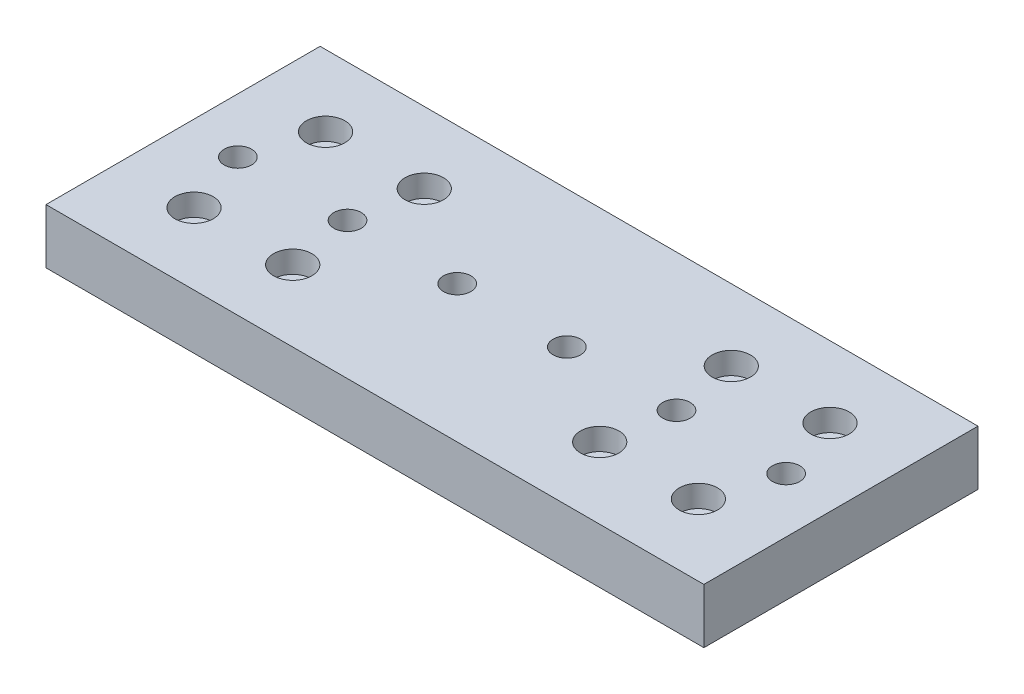
ISO-10303-21;
HEADER;
FILE_DESCRIPTION(('STEP AP214'),'2;1');
FILE_NAME('part.step','',(''),(''),'','','');
FILE_SCHEMA(('AUTOMOTIVE_DESIGN { 1 0 10303 214 1 1 1 1 }'));
ENDSEC;
DATA;
#1=APPLICATION_CONTEXT('core data for automotive mechanical design processes');
#2=APPLICATION_PROTOCOL_DEFINITION('international standard','automotive_design',2000,#1);
#3=PRODUCT_CONTEXT('',#1,'mechanical');
#4=PRODUCT('Part','Part','',(#3));
#5=PRODUCT_RELATED_PRODUCT_CATEGORY('part','',(#4));
#6=PRODUCT_DEFINITION_FORMATION('','',#4);
#7=PRODUCT_DEFINITION_CONTEXT('part definition',#1,'design');
#8=PRODUCT_DEFINITION('design','',#6,#7);
#9=PRODUCT_DEFINITION_SHAPE('','',#8);
#10=(LENGTH_UNIT() NAMED_UNIT(*) SI_UNIT(.MILLI.,.METRE.));
#11=(NAMED_UNIT(*) PLANE_ANGLE_UNIT() SI_UNIT($,.RADIAN.));
#12=(NAMED_UNIT(*) SI_UNIT($,.STERADIAN.) SOLID_ANGLE_UNIT());
#13=UNCERTAINTY_MEASURE_WITH_UNIT(LENGTH_MEASURE(1.E-05),#10,'distance_accuracy_value','');
#14=(GEOMETRIC_REPRESENTATION_CONTEXT(3) GLOBAL_UNCERTAINTY_ASSIGNED_CONTEXT((#13)) GLOBAL_UNIT_ASSIGNED_CONTEXT((#10,
#11,#12)) REPRESENTATION_CONTEXT('',''));
#15=CARTESIAN_POINT('',(0.,0.,0.));
#16=DIRECTION('',(0.,0.,1.));
#17=DIRECTION('',(1.,0.,0.));
#18=AXIS2_PLACEMENT_3D('',#15,#16,#17);
#19=CARTESIAN_POINT('',(50.,10.,0.));
#20=DIRECTION('',(0.,-1.,0.));
#21=DIRECTION('',(0.,0.,-1.));
#22=AXIS2_PLACEMENT_3D('',#19,#20,#21);
#23=CYLINDRICAL_SURFACE('',#22,2.49999999999999);
#24=CARTESIAN_POINT('',(50.,10.,0.));
#25=DIRECTION('',(0.,-1.,0.));
#26=DIRECTION('',(0.,0.,-1.));
#27=AXIS2_PLACEMENT_3D('',#24,#25,#26);
#28=CIRCLE('',#27,2.49999999999999);
#29=CARTESIAN_POINT('',(50.,10.,-2.49999999999999));
#30=VERTEX_POINT('',#29);
#31=EDGE_CURVE('E157',#30,#30,#28,.T.);
#32=ORIENTED_EDGE('',*,*,#31,.F.);
#33=EDGE_LOOP('',(#32));
#34=FACE_BOUND('',#33,.T.);
#35=CARTESIAN_POINT('',(50.,5.,0.));
#36=DIRECTION('',(0.,-1.,0.));
#37=DIRECTION('',(0.,0.,-1.));
#38=AXIS2_PLACEMENT_3D('',#35,#36,#37);
#39=CIRCLE('',#38,2.49999999999999);
#40=CARTESIAN_POINT('',(50.,5.,-2.49999999999999));
#41=VERTEX_POINT('',#40);
#42=EDGE_CURVE('E42',#41,#41,#39,.F.);
#43=ORIENTED_EDGE('',*,*,#42,.F.);
#44=EDGE_LOOP('',(#43));
#45=FACE_BOUND('',#44,.T.);
#46=ADVANCED_FACE('F38',(#34,#45),#23,.F.);
#47=CARTESIAN_POINT('',(30.,10.,0.));
#48=DIRECTION('',(0.,-1.,0.));
#49=DIRECTION('',(0.,0.,-1.));
#50=AXIS2_PLACEMENT_3D('',#47,#48,#49);
#51=CYLINDRICAL_SURFACE('',#50,2.49999999999999);
#52=CARTESIAN_POINT('',(30.,10.,0.));
#53=DIRECTION('',(0.,-1.,0.));
#54=DIRECTION('',(0.,0.,-1.));
#55=AXIS2_PLACEMENT_3D('',#52,#53,#54);
#56=CIRCLE('',#55,2.49999999999999);
#57=CARTESIAN_POINT('',(30.,10.,-2.49999999999999));
#58=VERTEX_POINT('',#57);
#59=EDGE_CURVE('E161',#58,#58,#56,.T.);
#60=ORIENTED_EDGE('',*,*,#59,.F.);
#61=EDGE_LOOP('',(#60));
#62=FACE_BOUND('',#61,.T.);
#63=CARTESIAN_POINT('',(30.,5.,0.));
#64=DIRECTION('',(0.,-1.,0.));
#65=DIRECTION('',(0.,0.,-1.));
#66=AXIS2_PLACEMENT_3D('',#63,#64,#65);
#67=CIRCLE('',#66,2.49999999999999);
#68=CARTESIAN_POINT('',(30.,5.,-2.49999999999999));
#69=VERTEX_POINT('',#68);
#70=EDGE_CURVE('E152',#69,#69,#67,.F.);
#71=ORIENTED_EDGE('',*,*,#70,.F.);
#72=EDGE_LOOP('',(#71));
#73=FACE_BOUND('',#72,.T.);
#74=ADVANCED_FACE('F262',(#62,#73),#51,.F.);
#75=CARTESIAN_POINT('',(9.99999999999999,10.,0.));
#76=DIRECTION('',(0.,-1.,0.));
#77=DIRECTION('',(0.,0.,-1.));
#78=AXIS2_PLACEMENT_3D('',#75,#76,#77);
#79=CYLINDRICAL_SURFACE('',#78,2.5);
#80=CARTESIAN_POINT('',(9.99999999999999,10.,0.));
#81=DIRECTION('',(0.,-1.,0.));
#82=DIRECTION('',(0.,0.,-1.));
#83=AXIS2_PLACEMENT_3D('',#80,#81,#82);
#84=CIRCLE('',#83,2.5);
#85=CARTESIAN_POINT('',(9.99999999999999,10.,-2.5));
#86=VERTEX_POINT('',#85);
#87=EDGE_CURVE('E166',#86,#86,#84,.T.);
#88=ORIENTED_EDGE('',*,*,#87,.F.);
#89=EDGE_LOOP('',(#88));
#90=FACE_BOUND('',#89,.T.);
#91=CARTESIAN_POINT('',(9.99999999999999,5.,0.));
#92=DIRECTION('',(0.,-1.,0.));
#93=DIRECTION('',(0.,0.,-1.));
#94=AXIS2_PLACEMENT_3D('',#91,#92,#93);
#95=CIRCLE('',#94,2.5);
#96=CARTESIAN_POINT('',(9.99999999999999,5.,-2.5));
#97=VERTEX_POINT('',#96);
#98=EDGE_CURVE('E150',#97,#97,#95,.F.);
#99=ORIENTED_EDGE('',*,*,#98,.F.);
#100=EDGE_LOOP('',(#99));
#101=FACE_BOUND('',#100,.T.);
#102=ADVANCED_FACE('F269',(#90,#101),#79,.F.);
#103=CARTESIAN_POINT('',(-10.,10.,0.));
#104=DIRECTION('',(0.,-1.,0.));
#105=DIRECTION('',(0.,0.,-1.));
#106=AXIS2_PLACEMENT_3D('',#103,#104,#105);
#107=CYLINDRICAL_SURFACE('',#106,2.5);
#108=CARTESIAN_POINT('',(-10.,10.,0.));
#109=DIRECTION('',(0.,-1.,0.));
#110=DIRECTION('',(0.,0.,-1.));
#111=AXIS2_PLACEMENT_3D('',#108,#109,#110);
#112=CIRCLE('',#111,2.5);
#113=CARTESIAN_POINT('',(-10.,10.,-2.5));
#114=VERTEX_POINT('',#113);
#115=EDGE_CURVE('E632',#114,#114,#112,.T.);
#116=ORIENTED_EDGE('',*,*,#115,.F.);
#117=EDGE_LOOP('',(#116));
#118=FACE_BOUND('',#117,.T.);
#119=CARTESIAN_POINT('',(-10.,5.,0.));
#120=DIRECTION('',(0.,-1.,0.));
#121=DIRECTION('',(0.,0.,-1.));
#122=AXIS2_PLACEMENT_3D('',#119,#120,#121);
#123=CIRCLE('',#122,2.5);
#124=CARTESIAN_POINT('',(-10.,5.,-2.5));
#125=VERTEX_POINT('',#124);
#126=EDGE_CURVE('E147',#125,#125,#123,.F.);
#127=ORIENTED_EDGE('',*,*,#126,.F.);
#128=EDGE_LOOP('',(#127));
#129=FACE_BOUND('',#128,.T.);
#130=ADVANCED_FACE('F467',(#118,#129),#107,.F.);
#131=CARTESIAN_POINT('',(-30.,10.,0.));
#132=DIRECTION('',(0.,-1.,0.));
#133=DIRECTION('',(0.,0.,-1.));
#134=AXIS2_PLACEMENT_3D('',#131,#132,#133);
#135=CYLINDRICAL_SURFACE('',#134,2.5);
#136=CARTESIAN_POINT('',(-30.,10.,0.));
#137=DIRECTION('',(0.,-1.,0.));
#138=DIRECTION('',(0.,0.,-1.));
#139=AXIS2_PLACEMENT_3D('',#136,#137,#138);
#140=CIRCLE('',#139,2.5);
#141=CARTESIAN_POINT('',(-30.,10.,-2.5));
#142=VERTEX_POINT('',#141);
#143=EDGE_CURVE('E629',#142,#142,#140,.T.);
#144=ORIENTED_EDGE('',*,*,#143,.F.);
#145=EDGE_LOOP('',(#144));
#146=FACE_BOUND('',#145,.T.);
#147=CARTESIAN_POINT('',(-30.,5.,0.));
#148=DIRECTION('',(0.,-1.,0.));
#149=DIRECTION('',(0.,0.,-1.));
#150=AXIS2_PLACEMENT_3D('',#147,#148,#149);
#151=CIRCLE('',#150,2.5);
#152=CARTESIAN_POINT('',(-30.,5.,-2.5));
#153=VERTEX_POINT('',#152);
#154=EDGE_CURVE('E143',#153,#153,#151,.F.);
#155=ORIENTED_EDGE('',*,*,#154,.F.);
#156=EDGE_LOOP('',(#155));
#157=FACE_BOUND('',#156,.T.);
#158=ADVANCED_FACE('F458',(#146,#157),#135,.F.);
#159=CARTESIAN_POINT('',(-50.,10.,0.));
#160=DIRECTION('',(0.,-1.,0.));
#161=DIRECTION('',(0.,0.,-1.));
#162=AXIS2_PLACEMENT_3D('',#159,#160,#161);
#163=CYLINDRICAL_SURFACE('',#162,2.5);
#164=CARTESIAN_POINT('',(-50.,10.,0.));
#165=DIRECTION('',(0.,-1.,0.));
#166=DIRECTION('',(0.,0.,-1.));
#167=AXIS2_PLACEMENT_3D('',#164,#165,#166);
#168=CIRCLE('',#167,2.5);
#169=CARTESIAN_POINT('',(-50.,10.,-2.5));
#170=VERTEX_POINT('',#169);
#171=EDGE_CURVE('E189',#170,#170,#168,.T.);
#172=ORIENTED_EDGE('',*,*,#171,.F.);
#173=EDGE_LOOP('',(#172));
#174=FACE_BOUND('',#173,.T.);
#175=CARTESIAN_POINT('',(-50.,5.,0.));
#176=DIRECTION('',(0.,-1.,0.));
#177=DIRECTION('',(0.,0.,-1.));
#178=AXIS2_PLACEMENT_3D('',#175,#176,#177);
#179=CIRCLE('',#178,2.5);
#180=CARTESIAN_POINT('',(-50.,5.,-2.5));
#181=VERTEX_POINT('',#180);
#182=EDGE_CURVE('E140',#181,#181,#179,.F.);
#183=ORIENTED_EDGE('',*,*,#182,.F.);
#184=EDGE_LOOP('',(#183));
#185=FACE_BOUND('',#184,.T.);
#186=ADVANCED_FACE('F348',(#174,#185),#163,.F.);
#187=CARTESIAN_POINT('',(-45.9999999999994,0.,-11.9999999999998));
#188=DIRECTION('',(0.,1.,0.));
#189=DIRECTION('',(0.,0.,1.));
#190=AXIS2_PLACEMENT_3D('',#187,#188,#189);
#191=CYLINDRICAL_SURFACE('',#190,1.5);
#192=CARTESIAN_POINT('',(-45.9999999999994,0.,-11.9999999999998));
#193=DIRECTION('',(0.,1.,0.));
#194=DIRECTION('',(0.,0.,1.));
#195=AXIS2_PLACEMENT_3D('',#192,#193,#194);
#196=CIRCLE('',#195,1.5);
#197=CARTESIAN_POINT('',(-45.9999999999994,0.,-10.4999999999998));
#198=VERTEX_POINT('',#197);
#199=EDGE_CURVE('E221',#198,#198,#196,.T.);
#200=ORIENTED_EDGE('',*,*,#199,.F.);
#201=EDGE_LOOP('',(#200));
#202=FACE_BOUND('',#201,.T.);
#203=CARTESIAN_POINT('',(-45.9999999999994,6.,-11.9999999999998));
#204=DIRECTION('',(0.,1.,0.));
#205=DIRECTION('',(0.,0.,1.));
#206=AXIS2_PLACEMENT_3D('',#203,#204,#205);
#207=CIRCLE('',#206,1.5);
#208=CARTESIAN_POINT('',(-45.9999999999994,6.,-10.4999999999998));
#209=VERTEX_POINT('',#208);
#210=EDGE_CURVE('E133',#209,#209,#207,.F.);
#211=ORIENTED_EDGE('',*,*,#210,.F.);
#212=EDGE_LOOP('',(#211));
#213=FACE_BOUND('',#212,.T.);
#214=ADVANCED_FACE('F345',(#202,#213),#191,.F.);
#215=CARTESIAN_POINT('',(-27.9999999999994,0.,-11.9999999999998));
#216=DIRECTION('',(0.,1.,0.));
#217=DIRECTION('',(0.,0.,1.));
#218=AXIS2_PLACEMENT_3D('',#215,#216,#217);
#219=CYLINDRICAL_SURFACE('',#218,1.5);
#220=CARTESIAN_POINT('',(-27.9999999999994,0.,-11.9999999999998));
#221=DIRECTION('',(0.,1.,0.));
#222=DIRECTION('',(0.,0.,1.));
#223=AXIS2_PLACEMENT_3D('',#220,#221,#222);
#224=CIRCLE('',#223,1.5);
#225=CARTESIAN_POINT('',(-27.9999999999994,0.,-10.4999999999998));
#226=VERTEX_POINT('',#225);
#227=EDGE_CURVE('E139',#226,#226,#224,.T.);
#228=ORIENTED_EDGE('',*,*,#227,.F.);
#229=EDGE_LOOP('',(#228));
#230=FACE_BOUND('',#229,.T.);
#231=CARTESIAN_POINT('',(-27.9999999999994,6.,-11.9999999999998));
#232=DIRECTION('',(0.,1.,0.));
#233=DIRECTION('',(0.,0.,1.));
#234=AXIS2_PLACEMENT_3D('',#231,#232,#233);
#235=CIRCLE('',#234,1.5);
#236=CARTESIAN_POINT('',(-27.9999999999994,6.,-10.4999999999998));
#237=VERTEX_POINT('',#236);
#238=EDGE_CURVE('E127',#237,#237,#235,.F.);
#239=ORIENTED_EDGE('',*,*,#238,.F.);
#240=EDGE_LOOP('',(#239));
#241=FACE_BOUND('',#240,.T.);
#242=ADVANCED_FACE('F341',(#230,#241),#219,.F.);
#243=CARTESIAN_POINT('',(45.9999999999994,0.,11.9999999999999));
#244=DIRECTION('',(0.,1.,0.));
#245=DIRECTION('',(0.,0.,1.));
#246=AXIS2_PLACEMENT_3D('',#243,#244,#245);
#247=CYLINDRICAL_SURFACE('',#246,1.5);
#248=CARTESIAN_POINT('',(45.9999999999994,0.,11.9999999999999));
#249=DIRECTION('',(0.,1.,0.));
#250=DIRECTION('',(0.,0.,1.));
#251=AXIS2_PLACEMENT_3D('',#248,#249,#250);
#252=CIRCLE('',#251,1.5);
#253=CARTESIAN_POINT('',(45.9999999999994,0.,13.4999999999998));
#254=VERTEX_POINT('',#253);
#255=EDGE_CURVE('E233',#254,#254,#252,.T.);
#256=ORIENTED_EDGE('',*,*,#255,.F.);
#257=EDGE_LOOP('',(#256));
#258=FACE_BOUND('',#257,.T.);
#259=CARTESIAN_POINT('',(45.9999999999994,6.,11.9999999999999));
#260=DIRECTION('',(0.,1.,0.));
#261=DIRECTION('',(0.,0.,1.));
#262=AXIS2_PLACEMENT_3D('',#259,#260,#261);
#263=CIRCLE('',#262,1.5);
#264=CARTESIAN_POINT('',(45.9999999999994,6.,13.4999999999998));
#265=VERTEX_POINT('',#264);
#266=EDGE_CURVE('E121',#265,#265,#263,.F.);
#267=ORIENTED_EDGE('',*,*,#266,.F.);
#268=EDGE_LOOP('',(#267));
#269=FACE_BOUND('',#268,.T.);
#270=ADVANCED_FACE('F344',(#258,#269),#247,.F.);
#271=CARTESIAN_POINT('',(27.9999999999994,0.,11.9999999999999));
#272=DIRECTION('',(0.,1.,0.));
#273=DIRECTION('',(0.,0.,1.));
#274=AXIS2_PLACEMENT_3D('',#271,#272,#273);
#275=CYLINDRICAL_SURFACE('',#274,1.5);
#276=CARTESIAN_POINT('',(27.9999999999994,0.,11.9999999999999));
#277=DIRECTION('',(0.,1.,0.));
#278=DIRECTION('',(0.,0.,1.));
#279=AXIS2_PLACEMENT_3D('',#276,#277,#278);
#280=CIRCLE('',#279,1.5);
#281=CARTESIAN_POINT('',(27.9999999999994,0.,13.4999999999999));
#282=VERTEX_POINT('',#281);
#283=EDGE_CURVE('E230',#282,#282,#280,.T.);
#284=ORIENTED_EDGE('',*,*,#283,.F.);
#285=EDGE_LOOP('',(#284));
#286=FACE_BOUND('',#285,.T.);
#287=CARTESIAN_POINT('',(27.9999999999994,6.,11.9999999999999));
#288=DIRECTION('',(0.,1.,0.));
#289=DIRECTION('',(0.,0.,1.));
#290=AXIS2_PLACEMENT_3D('',#287,#288,#289);
#291=CIRCLE('',#290,1.5);
#292=CARTESIAN_POINT('',(27.9999999999994,6.,13.4999999999999));
#293=VERTEX_POINT('',#292);
#294=EDGE_CURVE('E117',#293,#293,#291,.F.);
#295=ORIENTED_EDGE('',*,*,#294,.F.);
#296=EDGE_LOOP('',(#295));
#297=FACE_BOUND('',#296,.T.);
#298=ADVANCED_FACE('F354',(#286,#297),#275,.F.);
#299=CARTESIAN_POINT('',(-60.,10.,25.));
#300=DIRECTION('',(1.,0.,0.));
#301=DIRECTION('',(0.,0.,-1.));
#302=AXIS2_PLACEMENT_3D('',#299,#300,#301);
#303=PLANE('',#302);
#304=DIRECTION('',(0.,0.,1.));
#305=VECTOR('',#304,1.);
#306=CARTESIAN_POINT('',(-60.,0.,25.));
#307=LINE('',#306,#305);
#308=CARTESIAN_POINT('',(-60.,0.,-25.));
#309=VERTEX_POINT('',#308);
#310=CARTESIAN_POINT('',(-60.,0.,25.));
#311=VERTEX_POINT('',#310);
#312=EDGE_CURVE('E105',#309,#311,#307,.T.);
#313=ORIENTED_EDGE('',*,*,#312,.T.);
#314=DIRECTION('',(0.,-1.,0.));
#315=VECTOR('',#314,1.);
#316=CARTESIAN_POINT('',(-60.,10.,25.));
#317=LINE('',#316,#315);
#318=CARTESIAN_POINT('',(-60.,10.,25.));
#319=VERTEX_POINT('',#318);
#320=EDGE_CURVE('E11',#319,#311,#317,.T.);
#321=ORIENTED_EDGE('',*,*,#320,.F.);
#322=DIRECTION('',(0.,0.,1.));
#323=VECTOR('',#322,1.);
#324=CARTESIAN_POINT('',(-60.,10.,25.));
#325=LINE('',#324,#323);
#326=CARTESIAN_POINT('',(-60.,10.,-25.));
#327=VERTEX_POINT('',#326);
#328=EDGE_CURVE('E92',#327,#319,#325,.T.);
#329=ORIENTED_EDGE('',*,*,#328,.F.);
#330=DIRECTION('',(0.,-1.,0.));
#331=VECTOR('',#330,1.);
#332=CARTESIAN_POINT('',(-60.,10.,-25.));
#333=LINE('',#332,#331);
#334=EDGE_CURVE('E101',#327,#309,#333,.T.);
#335=ORIENTED_EDGE('',*,*,#334,.T.);
#336=EDGE_LOOP('',(#313,#321,#329,#335));
#337=FACE_BOUND('',#336,.T.);
#338=ADVANCED_FACE('F40',(#337),#303,.F.);
#339=CARTESIAN_POINT('',(60.,10.,25.));
#340=DIRECTION('',(0.,0.,-1.));
#341=DIRECTION('',(-1.,0.,0.));
#342=AXIS2_PLACEMENT_3D('',#339,#340,#341);
#343=PLANE('',#342);
#344=DIRECTION('',(1.,0.,0.));
#345=VECTOR('',#344,1.);
#346=CARTESIAN_POINT('',(60.,0.,25.));
#347=LINE('',#346,#345);
#348=CARTESIAN_POINT('',(60.,0.,25.));
#349=VERTEX_POINT('',#348);
#350=EDGE_CURVE('E96',#311,#349,#347,.T.);
#351=ORIENTED_EDGE('',*,*,#350,.T.);
#352=DIRECTION('',(0.,-1.,0.));
#353=VECTOR('',#352,1.);
#354=CARTESIAN_POINT('',(60.,10.,25.));
#355=LINE('',#354,#353);
#356=CARTESIAN_POINT('',(60.,10.,25.));
#357=VERTEX_POINT('',#356);
#358=EDGE_CURVE('E48',#357,#349,#355,.T.);
#359=ORIENTED_EDGE('',*,*,#358,.F.);
#360=DIRECTION('',(1.,0.,0.));
#361=VECTOR('',#360,1.);
#362=CARTESIAN_POINT('',(60.,10.,25.));
#363=LINE('',#362,#361);
#364=EDGE_CURVE('E87',#319,#357,#363,.T.);
#365=ORIENTED_EDGE('',*,*,#364,.F.);
#366=ORIENTED_EDGE('',*,*,#320,.T.);
#367=EDGE_LOOP('',(#351,#359,#365,#366));
#368=FACE_BOUND('',#367,.T.);
#369=ADVANCED_FACE('F95',(#368),#343,.F.);
#370=CARTESIAN_POINT('',(60.,10.,25.));
#371=DIRECTION('',(-1.,0.,0.));
#372=DIRECTION('',(0.,0.,1.));
#373=AXIS2_PLACEMENT_3D('',#370,#371,#372);
#374=PLANE('',#373);
#375=DIRECTION('',(0.,0.,-1.));
#376=VECTOR('',#375,1.);
#377=CARTESIAN_POINT('',(60.,0.,25.));
#378=LINE('',#377,#376);
#379=CARTESIAN_POINT('',(60.,0.,-25.));
#380=VERTEX_POINT('',#379);
#381=EDGE_CURVE('E74',#349,#380,#378,.T.);
#382=ORIENTED_EDGE('',*,*,#381,.T.);
#383=DIRECTION('',(0.,-1.,0.));
#384=VECTOR('',#383,1.);
#385=CARTESIAN_POINT('',(60.,10.,-25.));
#386=LINE('',#385,#384);
#387=CARTESIAN_POINT('',(60.,10.,-25.));
#388=VERTEX_POINT('',#387);
#389=EDGE_CURVE('E97',#388,#380,#386,.T.);
#390=ORIENTED_EDGE('',*,*,#389,.F.);
#391=DIRECTION('',(0.,0.,-1.));
#392=VECTOR('',#391,1.);
#393=CARTESIAN_POINT('',(60.,10.,25.));
#394=LINE('',#393,#392);
#395=EDGE_CURVE('E90',#357,#388,#394,.T.);
#396=ORIENTED_EDGE('',*,*,#395,.F.);
#397=ORIENTED_EDGE('',*,*,#358,.T.);
#398=EDGE_LOOP('',(#382,#390,#396,#397));
#399=FACE_BOUND('',#398,.T.);
#400=ADVANCED_FACE('F99',(#399),#374,.F.);
#401=CARTESIAN_POINT('',(60.,10.,-25.));
#402=DIRECTION('',(0.,0.,1.));
#403=DIRECTION('',(1.,0.,0.));
#404=AXIS2_PLACEMENT_3D('',#401,#402,#403);
#405=PLANE('',#404);
#406=DIRECTION('',(-1.,0.,0.));
#407=VECTOR('',#406,1.);
#408=CARTESIAN_POINT('',(60.,0.,-25.));
#409=LINE('',#408,#407);
#410=EDGE_CURVE('E80',#380,#309,#409,.T.);
#411=ORIENTED_EDGE('',*,*,#410,.T.);
#412=ORIENTED_EDGE('',*,*,#334,.F.);
#413=DIRECTION('',(-1.,0.,0.));
#414=VECTOR('',#413,1.);
#415=CARTESIAN_POINT('',(60.,10.,-25.));
#416=LINE('',#415,#414);
#417=EDGE_CURVE('E57',#388,#327,#416,.T.);
#418=ORIENTED_EDGE('',*,*,#417,.F.);
#419=ORIENTED_EDGE('',*,*,#389,.T.);
#420=EDGE_LOOP('',(#411,#412,#418,#419));
#421=FACE_BOUND('',#420,.T.);
#422=ADVANCED_FACE('F641',(#421),#405,.F.);
#423=CARTESIAN_POINT('',(0.,10.,0.));
#424=DIRECTION('',(0.,1.,0.));
#425=DIRECTION('',(0.,0.,1.));
#426=AXIS2_PLACEMENT_3D('',#423,#424,#425);
#427=PLANE('',#426);
#428=ORIENTED_EDGE('',*,*,#171,.T.);
#429=EDGE_LOOP('',(#428));
#430=FACE_BOUND('',#429,.T.);
#431=ORIENTED_EDGE('',*,*,#143,.T.);
#432=EDGE_LOOP('',(#431));
#433=FACE_BOUND('',#432,.T.);
#434=ORIENTED_EDGE('',*,*,#115,.T.);
#435=EDGE_LOOP('',(#434));
#436=FACE_BOUND('',#435,.T.);
#437=ORIENTED_EDGE('',*,*,#87,.T.);
#438=EDGE_LOOP('',(#437));
#439=FACE_BOUND('',#438,.T.);
#440=ORIENTED_EDGE('',*,*,#59,.T.);
#441=EDGE_LOOP('',(#440));
#442=FACE_BOUND('',#441,.T.);
#443=ORIENTED_EDGE('',*,*,#31,.T.);
#444=EDGE_LOOP('',(#443));
#445=FACE_BOUND('',#444,.T.);
#446=CARTESIAN_POINT('',(45.9999999999994,10.,11.9999999999999));
#447=DIRECTION('',(0.,1.,0.));
#448=DIRECTION('',(0.,0.,1.));
#449=AXIS2_PLACEMENT_3D('',#446,#447,#448);
#450=CIRCLE('',#449,3.50000000000001);
#451=CARTESIAN_POINT('',(45.9999999999994,10.,15.4999999999999));
#452=VERTEX_POINT('',#451);
#453=EDGE_CURVE('E173',#452,#452,#450,.T.);
#454=ORIENTED_EDGE('',*,*,#453,.F.);
#455=EDGE_LOOP('',(#454));
#456=FACE_BOUND('',#455,.T.);
#457=CARTESIAN_POINT('',(-45.9999999999994,10.,11.9999999999998));
#458=DIRECTION('',(0.,1.,0.));
#459=DIRECTION('',(0.,0.,-1.));
#460=AXIS2_PLACEMENT_3D('',#457,#458,#459);
#461=CIRCLE('',#460,3.5);
#462=CARTESIAN_POINT('',(-45.9999999999994,10.,8.49999999999978));
#463=VERTEX_POINT('',#462);
#464=EDGE_CURVE('E194',#463,#463,#461,.T.);
#465=ORIENTED_EDGE('',*,*,#464,.F.);
#466=EDGE_LOOP('',(#465));
#467=FACE_BOUND('',#466,.T.);
#468=CARTESIAN_POINT('',(-27.9999999999994,10.,11.9999999999998));
#469=DIRECTION('',(0.,1.,0.));
#470=DIRECTION('',(0.,0.,-1.));
#471=AXIS2_PLACEMENT_3D('',#468,#469,#470);
#472=CIRCLE('',#471,3.5);
#473=CARTESIAN_POINT('',(-27.9999999999994,10.,8.49999999999984));
#474=VERTEX_POINT('',#473);
#475=EDGE_CURVE('E193',#474,#474,#472,.T.);
#476=ORIENTED_EDGE('',*,*,#475,.F.);
#477=EDGE_LOOP('',(#476));
#478=FACE_BOUND('',#477,.T.);
#479=CARTESIAN_POINT('',(-27.9999999999994,10.,-11.9999999999998));
#480=DIRECTION('',(0.,1.,0.));
#481=DIRECTION('',(0.,0.,1.));
#482=AXIS2_PLACEMENT_3D('',#479,#480,#481);
#483=CIRCLE('',#482,3.5);
#484=CARTESIAN_POINT('',(-27.9999999999994,10.,-8.49999999999983));
#485=VERTEX_POINT('',#484);
#486=EDGE_CURVE('E206',#485,#485,#483,.T.);
#487=ORIENTED_EDGE('',*,*,#486,.F.);
#488=EDGE_LOOP('',(#487));
#489=FACE_BOUND('',#488,.T.);
#490=CARTESIAN_POINT('',(27.9999999999994,10.,11.9999999999999));
#491=DIRECTION('',(0.,1.,0.));
#492=DIRECTION('',(0.,0.,1.));
#493=AXIS2_PLACEMENT_3D('',#490,#491,#492);
#494=CIRCLE('',#493,3.5);
#495=CARTESIAN_POINT('',(27.9999999999994,10.,15.4999999999999));
#496=VERTEX_POINT('',#495);
#497=EDGE_CURVE('E174',#496,#496,#494,.T.);
#498=ORIENTED_EDGE('',*,*,#497,.F.);
#499=EDGE_LOOP('',(#498));
#500=FACE_BOUND('',#499,.T.);
#501=CARTESIAN_POINT('',(27.9999999999994,10.,-11.9999999999998));
#502=DIRECTION('',(0.,1.,0.));
#503=DIRECTION('',(0.,0.,-1.));
#504=AXIS2_PLACEMENT_3D('',#501,#502,#503);
#505=CIRCLE('',#504,3.5);
#506=CARTESIAN_POINT('',(27.9999999999994,10.,-15.4999999999998));
#507=VERTEX_POINT('',#506);
#508=EDGE_CURVE('E180',#507,#507,#505,.T.);
#509=ORIENTED_EDGE('',*,*,#508,.F.);
#510=EDGE_LOOP('',(#509));
#511=FACE_BOUND('',#510,.T.);
#512=CARTESIAN_POINT('',(45.9999999999994,10.,-11.9999999999997));
#513=DIRECTION('',(0.,1.,0.));
#514=DIRECTION('',(0.,0.,-1.));
#515=AXIS2_PLACEMENT_3D('',#512,#513,#514);
#516=CIRCLE('',#515,3.49999999999999);
#517=CARTESIAN_POINT('',(45.9999999999994,10.,-15.4999999999997));
#518=VERTEX_POINT('',#517);
#519=EDGE_CURVE('E186',#518,#518,#516,.T.);
#520=ORIENTED_EDGE('',*,*,#519,.F.);
#521=EDGE_LOOP('',(#520));
#522=FACE_BOUND('',#521,.T.);
#523=CARTESIAN_POINT('',(-45.9999999999994,10.,-11.9999999999998));
#524=DIRECTION('',(0.,1.,0.));
#525=DIRECTION('',(0.,0.,1.));
#526=AXIS2_PLACEMENT_3D('',#523,#524,#525);
#527=CIRCLE('',#526,3.5);
#528=CARTESIAN_POINT('',(-45.9999999999994,10.,-8.49999999999977));
#529=VERTEX_POINT('',#528);
#530=EDGE_CURVE('E205',#529,#529,#527,.T.);
#531=ORIENTED_EDGE('',*,*,#530,.F.);
#532=EDGE_LOOP('',(#531));
#533=FACE_BOUND('',#532,.T.);
#534=ORIENTED_EDGE('',*,*,#328,.T.);
#535=ORIENTED_EDGE('',*,*,#364,.T.);
#536=ORIENTED_EDGE('',*,*,#395,.T.);
#537=ORIENTED_EDGE('',*,*,#417,.T.);
#538=EDGE_LOOP('',(#534,#535,#536,#537));
#539=FACE_BOUND('',#538,.T.);
#540=ADVANCED_FACE('F88',(#430,#433,#436,#439,#442,#445,#456,#467,#478,#489,#500,#511,#522,#533,
#539),#427,.T.);
#541=CARTESIAN_POINT('',(0.,0.,0.));
#542=DIRECTION('',(0.,1.,0.));
#543=DIRECTION('',(0.,0.,1.));
#544=AXIS2_PLACEMENT_3D('',#541,#542,#543);
#545=PLANE('',#544);
#546=CARTESIAN_POINT('',(-50.,0.,0.));
#547=DIRECTION('',(0.,-1.,0.));
#548=DIRECTION('',(0.,0.,-1.));
#549=AXIS2_PLACEMENT_3D('',#546,#547,#548);
#550=CIRCLE('',#549,4.3);
#551=CARTESIAN_POINT('',(-50.,0.,-4.3));
#552=VERTEX_POINT('',#551);
#553=EDGE_CURVE('E823',#552,#552,#550,.T.);
#554=ORIENTED_EDGE('',*,*,#553,.F.);
#555=EDGE_LOOP('',(#554));
#556=FACE_BOUND('',#555,.T.);
#557=CARTESIAN_POINT('',(-30.,0.,0.));
#558=DIRECTION('',(0.,-1.,0.));
#559=DIRECTION('',(0.,0.,-1.));
#560=AXIS2_PLACEMENT_3D('',#557,#558,#559);
#561=CIRCLE('',#560,4.3);
#562=CARTESIAN_POINT('',(-30.,0.,-4.3));
#563=VERTEX_POINT('',#562);
#564=EDGE_CURVE('E817',#563,#563,#561,.T.);
#565=ORIENTED_EDGE('',*,*,#564,.F.);
#566=EDGE_LOOP('',(#565));
#567=FACE_BOUND('',#566,.T.);
#568=CARTESIAN_POINT('',(-10.,0.,0.));
#569=DIRECTION('',(0.,-1.,0.));
#570=DIRECTION('',(0.,0.,-1.));
#571=AXIS2_PLACEMENT_3D('',#568,#569,#570);
#572=CIRCLE('',#571,4.3);
#573=CARTESIAN_POINT('',(-10.,0.,-4.3));
#574=VERTEX_POINT('',#573);
#575=EDGE_CURVE('E811',#574,#574,#572,.T.);
#576=ORIENTED_EDGE('',*,*,#575,.F.);
#577=EDGE_LOOP('',(#576));
#578=FACE_BOUND('',#577,.T.);
#579=CARTESIAN_POINT('',(9.99999999999999,0.,0.));
#580=DIRECTION('',(0.,-1.,0.));
#581=DIRECTION('',(0.,0.,-1.));
#582=AXIS2_PLACEMENT_3D('',#579,#580,#581);
#583=CIRCLE('',#582,4.3);
#584=CARTESIAN_POINT('',(9.99999999999999,0.,-4.3));
#585=VERTEX_POINT('',#584);
#586=EDGE_CURVE('E805',#585,#585,#583,.T.);
#587=ORIENTED_EDGE('',*,*,#586,.F.);
#588=EDGE_LOOP('',(#587));
#589=FACE_BOUND('',#588,.T.);
#590=CARTESIAN_POINT('',(30.,0.,0.));
#591=DIRECTION('',(0.,-1.,0.));
#592=DIRECTION('',(0.,0.,-1.));
#593=AXIS2_PLACEMENT_3D('',#590,#591,#592);
#594=CIRCLE('',#593,4.3);
#595=CARTESIAN_POINT('',(30.,0.,-4.3));
#596=VERTEX_POINT('',#595);
#597=EDGE_CURVE('E623',#596,#596,#594,.T.);
#598=ORIENTED_EDGE('',*,*,#597,.F.);
#599=EDGE_LOOP('',(#598));
#600=FACE_BOUND('',#599,.T.);
#601=CARTESIAN_POINT('',(50.,0.,0.));
#602=DIRECTION('',(0.,-1.,0.));
#603=DIRECTION('',(0.,0.,-1.));
#604=AXIS2_PLACEMENT_3D('',#601,#602,#603);
#605=CIRCLE('',#604,4.3);
#606=CARTESIAN_POINT('',(50.,0.,-4.3));
#607=VERTEX_POINT('',#606);
#608=EDGE_CURVE('E620',#607,#607,#605,.T.);
#609=ORIENTED_EDGE('',*,*,#608,.F.);
#610=EDGE_LOOP('',(#609));
#611=FACE_BOUND('',#610,.T.);
#612=CARTESIAN_POINT('',(-45.9999999999994,0.,11.9999999999998));
#613=DIRECTION('',(0.,1.,0.));
#614=DIRECTION('',(0.,0.,-1.));
#615=AXIS2_PLACEMENT_3D('',#612,#613,#614);
#616=CIRCLE('',#615,1.5);
#617=CARTESIAN_POINT('',(-45.9999999999994,0.,10.4999999999998));
#618=VERTEX_POINT('',#617);
#619=EDGE_CURVE('E227',#618,#618,#616,.T.);
#620=ORIENTED_EDGE('',*,*,#619,.T.);
#621=EDGE_LOOP('',(#620));
#622=FACE_BOUND('',#621,.T.);
#623=ORIENTED_EDGE('',*,*,#283,.T.);
#624=EDGE_LOOP('',(#623));
#625=FACE_BOUND('',#624,.T.);
#626=ORIENTED_EDGE('',*,*,#255,.T.);
#627=EDGE_LOOP('',(#626));
#628=FACE_BOUND('',#627,.T.);
#629=CARTESIAN_POINT('',(45.9999999999994,0.,-11.9999999999997));
#630=DIRECTION('',(0.,1.,0.));
#631=DIRECTION('',(0.,0.,-1.));
#632=AXIS2_PLACEMENT_3D('',#629,#630,#631);
#633=CIRCLE('',#632,1.50000000000001);
#634=CARTESIAN_POINT('',(45.9999999999994,0.,-13.4999999999997));
#635=VERTEX_POINT('',#634);
#636=EDGE_CURVE('E224',#635,#635,#633,.T.);
#637=ORIENTED_EDGE('',*,*,#636,.T.);
#638=EDGE_LOOP('',(#637));
#639=FACE_BOUND('',#638,.T.);
#640=ORIENTED_EDGE('',*,*,#227,.T.);
#641=EDGE_LOOP('',(#640));
#642=FACE_BOUND('',#641,.T.);
#643=CARTESIAN_POINT('',(27.9999999999994,0.,-11.9999999999998));
#644=DIRECTION('',(0.,1.,0.));
#645=DIRECTION('',(0.,0.,-1.));
#646=AXIS2_PLACEMENT_3D('',#643,#644,#645);
#647=CIRCLE('',#646,1.5);
#648=CARTESIAN_POINT('',(27.9999999999994,0.,-13.4999999999998));
#649=VERTEX_POINT('',#648);
#650=EDGE_CURVE('E220',#649,#649,#647,.T.);
#651=ORIENTED_EDGE('',*,*,#650,.T.);
#652=EDGE_LOOP('',(#651));
#653=FACE_BOUND('',#652,.T.);
#654=ORIENTED_EDGE('',*,*,#199,.T.);
#655=EDGE_LOOP('',(#654));
#656=FACE_BOUND('',#655,.T.);
#657=CARTESIAN_POINT('',(-27.9999999999994,0.,11.9999999999998));
#658=DIRECTION('',(0.,1.,0.));
#659=DIRECTION('',(0.,0.,-1.));
#660=AXIS2_PLACEMENT_3D('',#657,#658,#659);
#661=CIRCLE('',#660,1.5);
#662=CARTESIAN_POINT('',(-27.9999999999994,0.,10.4999999999998));
#663=VERTEX_POINT('',#662);
#664=EDGE_CURVE('E108',#663,#663,#661,.T.);
#665=ORIENTED_EDGE('',*,*,#664,.T.);
#666=EDGE_LOOP('',(#665));
#667=FACE_BOUND('',#666,.T.);
#668=ORIENTED_EDGE('',*,*,#312,.F.);
#669=ORIENTED_EDGE('',*,*,#410,.F.);
#670=ORIENTED_EDGE('',*,*,#381,.F.);
#671=ORIENTED_EDGE('',*,*,#350,.F.);
#672=EDGE_LOOP('',(#668,#669,#670,#671));
#673=FACE_BOUND('',#672,.T.);
#674=ADVANCED_FACE('F241',(#556,#567,#578,#589,#600,#611,#622,#625,#628,#639,#642,#653,#656,
#667,#673),#545,.F.);
#675=CARTESIAN_POINT('',(-27.9999999999994,0.,11.9999999999998));
#676=DIRECTION('',(0.,1.,0.));
#677=DIRECTION('',(0.,0.,1.));
#678=AXIS2_PLACEMENT_3D('',#675,#676,#677);
#679=CYLINDRICAL_SURFACE('',#678,1.5);
#680=CARTESIAN_POINT('',(-27.9999999999994,6.,11.9999999999998));
#681=DIRECTION('',(0.,-1.,0.));
#682=DIRECTION('',(0.,0.,-1.));
#683=AXIS2_PLACEMENT_3D('',#680,#681,#682);
#684=CIRCLE('',#683,1.5);
#685=CARTESIAN_POINT('',(-27.9999999999994,6.,10.4999999999998));
#686=VERTEX_POINT('',#685);
#687=EDGE_CURVE('E136',#686,#686,#684,.F.);
#688=ORIENTED_EDGE('',*,*,#687,.T.);
#689=EDGE_LOOP('',(#688));
#690=FACE_BOUND('',#689,.T.);
#691=ORIENTED_EDGE('',*,*,#664,.F.);
#692=EDGE_LOOP('',(#691));
#693=FACE_BOUND('',#692,.T.);
#694=ADVANCED_FACE('F244',(#690,#693),#679,.F.);
#695=CARTESIAN_POINT('',(27.9999999999994,0.,-11.9999999999998));
#696=DIRECTION('',(0.,1.,0.));
#697=DIRECTION('',(0.,0.,1.));
#698=AXIS2_PLACEMENT_3D('',#695,#696,#697);
#699=CYLINDRICAL_SURFACE('',#698,1.5);
#700=CARTESIAN_POINT('',(27.9999999999994,6.,-11.9999999999998));
#701=DIRECTION('',(0.,-1.,0.));
#702=DIRECTION('',(0.,0.,-1.));
#703=AXIS2_PLACEMENT_3D('',#700,#701,#702);
#704=CIRCLE('',#703,1.5);
#705=CARTESIAN_POINT('',(27.9999999999994,6.,-13.4999999999998));
#706=VERTEX_POINT('',#705);
#707=EDGE_CURVE('E130',#706,#706,#704,.F.);
#708=ORIENTED_EDGE('',*,*,#707,.T.);
#709=EDGE_LOOP('',(#708));
#710=FACE_BOUND('',#709,.T.);
#711=ORIENTED_EDGE('',*,*,#650,.F.);
#712=EDGE_LOOP('',(#711));
#713=FACE_BOUND('',#712,.T.);
#714=ADVANCED_FACE('F246',(#710,#713),#699,.F.);
#715=CARTESIAN_POINT('',(45.9999999999994,0.,-11.9999999999997));
#716=DIRECTION('',(0.,1.,0.));
#717=DIRECTION('',(0.,0.,1.));
#718=AXIS2_PLACEMENT_3D('',#715,#716,#717);
#719=CYLINDRICAL_SURFACE('',#718,1.50000000000001);
#720=CARTESIAN_POINT('',(45.9999999999994,6.,-11.9999999999997));
#721=DIRECTION('',(0.,-1.,0.));
#722=DIRECTION('',(0.,0.,-1.));
#723=AXIS2_PLACEMENT_3D('',#720,#721,#722);
#724=CIRCLE('',#723,1.50000000000001);
#725=CARTESIAN_POINT('',(45.9999999999994,6.,-13.4999999999997));
#726=VERTEX_POINT('',#725);
#727=EDGE_CURVE('E124',#726,#726,#724,.F.);
#728=ORIENTED_EDGE('',*,*,#727,.T.);
#729=EDGE_LOOP('',(#728));
#730=FACE_BOUND('',#729,.T.);
#731=ORIENTED_EDGE('',*,*,#636,.F.);
#732=EDGE_LOOP('',(#731));
#733=FACE_BOUND('',#732,.T.);
#734=ADVANCED_FACE('F253',(#730,#733),#719,.F.);
#735=CARTESIAN_POINT('',(-45.9999999999994,0.,11.9999999999998));
#736=DIRECTION('',(0.,1.,0.));
#737=DIRECTION('',(0.,0.,1.));
#738=AXIS2_PLACEMENT_3D('',#735,#736,#737);
#739=CYLINDRICAL_SURFACE('',#738,1.5);
#740=CARTESIAN_POINT('',(-45.9999999999994,6.,11.9999999999998));
#741=DIRECTION('',(0.,-1.,0.));
#742=DIRECTION('',(0.,0.,-1.));
#743=AXIS2_PLACEMENT_3D('',#740,#741,#742);
#744=CIRCLE('',#743,1.5);
#745=CARTESIAN_POINT('',(-45.9999999999994,6.,10.4999999999998));
#746=VERTEX_POINT('',#745);
#747=EDGE_CURVE('E114',#746,#746,#744,.F.);
#748=ORIENTED_EDGE('',*,*,#747,.T.);
#749=EDGE_LOOP('',(#748));
#750=FACE_BOUND('',#749,.T.);
#751=ORIENTED_EDGE('',*,*,#619,.F.);
#752=EDGE_LOOP('',(#751));
#753=FACE_BOUND('',#752,.T.);
#754=ADVANCED_FACE('F308',(#750,#753),#739,.F.);
#755=CARTESIAN_POINT('',(-45.9999999999994,6.,11.9999999999998));
#756=DIRECTION('',(0.,-1.,0.));
#757=DIRECTION('',(0.,0.,-1.));
#758=AXIS2_PLACEMENT_3D('',#755,#756,#757);
#759=PLANE('',#758);
#760=CARTESIAN_POINT('',(-45.9999999999994,6.,11.9999999999998));
#761=DIRECTION('',(0.,1.,0.));
#762=DIRECTION('',(0.,0.,-1.));
#763=AXIS2_PLACEMENT_3D('',#760,#761,#762);
#764=CIRCLE('',#763,3.5);
#765=CARTESIAN_POINT('',(-45.9999999999994,6.,8.49999999999978));
#766=VERTEX_POINT('',#765);
#767=EDGE_CURVE('E190',#766,#766,#764,.T.);
#768=ORIENTED_EDGE('',*,*,#767,.T.);
#769=EDGE_LOOP('',(#768));
#770=FACE_BOUND('',#769,.T.);
#771=ORIENTED_EDGE('',*,*,#747,.F.);
#772=EDGE_LOOP('',(#771));
#773=FACE_BOUND('',#772,.T.);
#774=ADVANCED_FACE('F305',(#770,#773),#759,.F.);
#775=CARTESIAN_POINT('',(-45.9999999999994,6.,11.9999999999998));
#776=DIRECTION('',(0.,1.,0.));
#777=DIRECTION('',(0.,0.,1.));
#778=AXIS2_PLACEMENT_3D('',#775,#776,#777);
#779=CYLINDRICAL_SURFACE('',#778,3.5);
#780=ORIENTED_EDGE('',*,*,#767,.F.);
#781=EDGE_LOOP('',(#780));
#782=FACE_BOUND('',#781,.T.);
#783=ORIENTED_EDGE('',*,*,#464,.T.);
#784=EDGE_LOOP('',(#783));
#785=FACE_BOUND('',#784,.T.);
#786=ADVANCED_FACE('F279',(#782,#785),#779,.F.);
#787=CARTESIAN_POINT('',(27.9999999999994,6.,11.9999999999999));
#788=DIRECTION('',(0.,1.,0.));
#789=DIRECTION('',(0.,0.,1.));
#790=AXIS2_PLACEMENT_3D('',#787,#788,#789);
#791=PLANE('',#790);
#792=CARTESIAN_POINT('',(27.9999999999994,6.,11.9999999999999));
#793=DIRECTION('',(0.,1.,0.));
#794=DIRECTION('',(0.,0.,1.));
#795=AXIS2_PLACEMENT_3D('',#792,#793,#794);
#796=CIRCLE('',#795,3.5);
#797=CARTESIAN_POINT('',(27.9999999999994,6.,15.4999999999999));
#798=VERTEX_POINT('',#797);
#799=EDGE_CURVE('E170',#798,#798,#796,.T.);
#800=ORIENTED_EDGE('',*,*,#799,.T.);
#801=EDGE_LOOP('',(#800));
#802=FACE_BOUND('',#801,.T.);
#803=ORIENTED_EDGE('',*,*,#294,.T.);
#804=EDGE_LOOP('',(#803));
#805=FACE_BOUND('',#804,.T.);
#806=ADVANCED_FACE('F275',(#802,#805),#791,.T.);
#807=CARTESIAN_POINT('',(27.9999999999994,6.,11.9999999999999));
#808=DIRECTION('',(0.,1.,0.));
#809=DIRECTION('',(0.,0.,1.));
#810=AXIS2_PLACEMENT_3D('',#807,#808,#809);
#811=CYLINDRICAL_SURFACE('',#810,3.5);
#812=ORIENTED_EDGE('',*,*,#799,.F.);
#813=EDGE_LOOP('',(#812));
#814=FACE_BOUND('',#813,.T.);
#815=ORIENTED_EDGE('',*,*,#497,.T.);
#816=EDGE_LOOP('',(#815));
#817=FACE_BOUND('',#816,.T.);
#818=ADVANCED_FACE('F278',(#814,#817),#811,.F.);
#819=CARTESIAN_POINT('',(45.9999999999994,6.,11.9999999999999));
#820=DIRECTION('',(0.,1.,0.));
#821=DIRECTION('',(0.,0.,1.));
#822=AXIS2_PLACEMENT_3D('',#819,#820,#821);
#823=PLANE('',#822);
#824=CARTESIAN_POINT('',(45.9999999999994,6.,11.9999999999999));
#825=DIRECTION('',(0.,1.,0.));
#826=DIRECTION('',(0.,0.,1.));
#827=AXIS2_PLACEMENT_3D('',#824,#825,#826);
#828=CIRCLE('',#827,3.50000000000001);
#829=CARTESIAN_POINT('',(45.9999999999994,6.,15.4999999999999));
#830=VERTEX_POINT('',#829);
#831=EDGE_CURVE('E197',#830,#830,#828,.T.);
#832=ORIENTED_EDGE('',*,*,#831,.T.);
#833=EDGE_LOOP('',(#832));
#834=FACE_BOUND('',#833,.T.);
#835=ORIENTED_EDGE('',*,*,#266,.T.);
#836=EDGE_LOOP('',(#835));
#837=FACE_BOUND('',#836,.T.);
#838=ADVANCED_FACE('F283',(#834,#837),#823,.T.);
#839=CARTESIAN_POINT('',(45.9999999999994,6.,11.9999999999999));
#840=DIRECTION('',(0.,1.,0.));
#841=DIRECTION('',(0.,0.,1.));
#842=AXIS2_PLACEMENT_3D('',#839,#840,#841);
#843=CYLINDRICAL_SURFACE('',#842,3.50000000000001);
#844=ORIENTED_EDGE('',*,*,#831,.F.);
#845=EDGE_LOOP('',(#844));
#846=FACE_BOUND('',#845,.T.);
#847=ORIENTED_EDGE('',*,*,#453,.T.);
#848=EDGE_LOOP('',(#847));
#849=FACE_BOUND('',#848,.T.);
#850=ADVANCED_FACE('F299',(#846,#849),#843,.F.);
#851=CARTESIAN_POINT('',(45.9999999999994,6.,-11.9999999999997));
#852=DIRECTION('',(0.,-1.,0.));
#853=DIRECTION('',(0.,0.,-1.));
#854=AXIS2_PLACEMENT_3D('',#851,#852,#853);
#855=PLANE('',#854);
#856=CARTESIAN_POINT('',(45.9999999999994,6.,-11.9999999999997));
#857=DIRECTION('',(0.,1.,0.));
#858=DIRECTION('',(0.,0.,-1.));
#859=AXIS2_PLACEMENT_3D('',#856,#857,#858);
#860=CIRCLE('',#859,3.49999999999999);
#861=CARTESIAN_POINT('',(45.9999999999994,6.,-15.4999999999997));
#862=VERTEX_POINT('',#861);
#863=EDGE_CURVE('E183',#862,#862,#860,.T.);
#864=ORIENTED_EDGE('',*,*,#863,.T.);
#865=EDGE_LOOP('',(#864));
#866=FACE_BOUND('',#865,.T.);
#867=ORIENTED_EDGE('',*,*,#727,.F.);
#868=EDGE_LOOP('',(#867));
#869=FACE_BOUND('',#868,.T.);
#870=ADVANCED_FACE('F295',(#866,#869),#855,.F.);
#871=CARTESIAN_POINT('',(45.9999999999994,6.,-11.9999999999997));
#872=DIRECTION('',(0.,1.,0.));
#873=DIRECTION('',(0.,0.,1.));
#874=AXIS2_PLACEMENT_3D('',#871,#872,#873);
#875=CYLINDRICAL_SURFACE('',#874,3.49999999999999);
#876=ORIENTED_EDGE('',*,*,#863,.F.);
#877=EDGE_LOOP('',(#876));
#878=FACE_BOUND('',#877,.T.);
#879=ORIENTED_EDGE('',*,*,#519,.T.);
#880=EDGE_LOOP('',(#879));
#881=FACE_BOUND('',#880,.T.);
#882=ADVANCED_FACE('F298',(#878,#881),#875,.F.);
#883=CARTESIAN_POINT('',(-27.9999999999994,6.,-11.9999999999998));
#884=DIRECTION('',(0.,1.,0.));
#885=DIRECTION('',(0.,0.,1.));
#886=AXIS2_PLACEMENT_3D('',#883,#884,#885);
#887=PLANE('',#886);
#888=CARTESIAN_POINT('',(-27.9999999999994,6.,-11.9999999999998));
#889=DIRECTION('',(0.,1.,0.));
#890=DIRECTION('',(0.,0.,1.));
#891=AXIS2_PLACEMENT_3D('',#888,#889,#890);
#892=CIRCLE('',#891,3.5);
#893=CARTESIAN_POINT('',(-27.9999999999994,6.,-8.49999999999983));
#894=VERTEX_POINT('',#893);
#895=EDGE_CURVE('E202',#894,#894,#892,.T.);
#896=ORIENTED_EDGE('',*,*,#895,.T.);
#897=EDGE_LOOP('',(#896));
#898=FACE_BOUND('',#897,.T.);
#899=ORIENTED_EDGE('',*,*,#238,.T.);
#900=EDGE_LOOP('',(#899));
#901=FACE_BOUND('',#900,.T.);
#902=ADVANCED_FACE('F303',(#898,#901),#887,.T.);
#903=CARTESIAN_POINT('',(-27.9999999999994,6.,-11.9999999999998));
#904=DIRECTION('',(0.,1.,0.));
#905=DIRECTION('',(0.,0.,1.));
#906=AXIS2_PLACEMENT_3D('',#903,#904,#905);
#907=CYLINDRICAL_SURFACE('',#906,3.5);
#908=ORIENTED_EDGE('',*,*,#895,.F.);
#909=EDGE_LOOP('',(#908));
#910=FACE_BOUND('',#909,.T.);
#911=ORIENTED_EDGE('',*,*,#486,.T.);
#912=EDGE_LOOP('',(#911));
#913=FACE_BOUND('',#912,.T.);
#914=ADVANCED_FACE('F289',(#910,#913),#907,.F.);
#915=CARTESIAN_POINT('',(27.9999999999994,6.,-11.9999999999998));
#916=DIRECTION('',(0.,-1.,0.));
#917=DIRECTION('',(0.,0.,-1.));
#918=AXIS2_PLACEMENT_3D('',#915,#916,#917);
#919=PLANE('',#918);
#920=CARTESIAN_POINT('',(27.9999999999994,6.,-11.9999999999998));
#921=DIRECTION('',(0.,1.,0.));
#922=DIRECTION('',(0.,0.,-1.));
#923=AXIS2_PLACEMENT_3D('',#920,#921,#922);
#924=CIRCLE('',#923,3.5);
#925=CARTESIAN_POINT('',(27.9999999999994,6.,-15.4999999999998));
#926=VERTEX_POINT('',#925);
#927=EDGE_CURVE('E177',#926,#926,#924,.T.);
#928=ORIENTED_EDGE('',*,*,#927,.T.);
#929=EDGE_LOOP('',(#928));
#930=FACE_BOUND('',#929,.T.);
#931=ORIENTED_EDGE('',*,*,#707,.F.);
#932=EDGE_LOOP('',(#931));
#933=FACE_BOUND('',#932,.T.);
#934=ADVANCED_FACE('F285',(#930,#933),#919,.F.);
#935=CARTESIAN_POINT('',(27.9999999999994,6.,-11.9999999999998));
#936=DIRECTION('',(0.,1.,0.));
#937=DIRECTION('',(0.,0.,1.));
#938=AXIS2_PLACEMENT_3D('',#935,#936,#937);
#939=CYLINDRICAL_SURFACE('',#938,3.5);
#940=ORIENTED_EDGE('',*,*,#927,.F.);
#941=EDGE_LOOP('',(#940));
#942=FACE_BOUND('',#941,.T.);
#943=ORIENTED_EDGE('',*,*,#508,.T.);
#944=EDGE_LOOP('',(#943));
#945=FACE_BOUND('',#944,.T.);
#946=ADVANCED_FACE('F288',(#942,#945),#939,.F.);
#947=CARTESIAN_POINT('',(-45.9999999999994,6.,-11.9999999999998));
#948=DIRECTION('',(0.,1.,0.));
#949=DIRECTION('',(0.,0.,1.));
#950=AXIS2_PLACEMENT_3D('',#947,#948,#949);
#951=PLANE('',#950);
#952=CARTESIAN_POINT('',(-45.9999999999994,6.,-11.9999999999998));
#953=DIRECTION('',(0.,1.,0.));
#954=DIRECTION('',(0.,0.,1.));
#955=AXIS2_PLACEMENT_3D('',#952,#953,#954);
#956=CIRCLE('',#955,3.5);
#957=CARTESIAN_POINT('',(-45.9999999999994,6.,-8.49999999999977));
#958=VERTEX_POINT('',#957);
#959=EDGE_CURVE('E118',#958,#958,#956,.T.);
#960=ORIENTED_EDGE('',*,*,#959,.T.);
#961=EDGE_LOOP('',(#960));
#962=FACE_BOUND('',#961,.T.);
#963=ORIENTED_EDGE('',*,*,#210,.T.);
#964=EDGE_LOOP('',(#963));
#965=FACE_BOUND('',#964,.T.);
#966=ADVANCED_FACE('F293',(#962,#965),#951,.T.);
#967=CARTESIAN_POINT('',(-45.9999999999994,6.,-11.9999999999998));
#968=DIRECTION('',(0.,1.,0.));
#969=DIRECTION('',(0.,0.,1.));
#970=AXIS2_PLACEMENT_3D('',#967,#968,#969);
#971=CYLINDRICAL_SURFACE('',#970,3.5);
#972=ORIENTED_EDGE('',*,*,#959,.F.);
#973=EDGE_LOOP('',(#972));
#974=FACE_BOUND('',#973,.T.);
#975=ORIENTED_EDGE('',*,*,#530,.T.);
#976=EDGE_LOOP('',(#975));
#977=FACE_BOUND('',#976,.T.);
#978=ADVANCED_FACE('F329',(#974,#977),#971,.F.);
#979=CARTESIAN_POINT('',(-27.9999999999994,6.,11.9999999999998));
#980=DIRECTION('',(0.,-1.,0.));
#981=DIRECTION('',(0.,0.,-1.));
#982=AXIS2_PLACEMENT_3D('',#979,#980,#981);
#983=PLANE('',#982);
#984=CARTESIAN_POINT('',(-27.9999999999994,6.,11.9999999999998));
#985=DIRECTION('',(0.,1.,0.));
#986=DIRECTION('',(0.,0.,-1.));
#987=AXIS2_PLACEMENT_3D('',#984,#985,#986);
#988=CIRCLE('',#987,3.5);
#989=CARTESIAN_POINT('',(-27.9999999999994,6.,8.49999999999984));
#990=VERTEX_POINT('',#989);
#991=EDGE_CURVE('E209',#990,#990,#988,.T.);
#992=ORIENTED_EDGE('',*,*,#991,.T.);
#993=EDGE_LOOP('',(#992));
#994=FACE_BOUND('',#993,.T.);
#995=ORIENTED_EDGE('',*,*,#687,.F.);
#996=EDGE_LOOP('',(#995));
#997=FACE_BOUND('',#996,.T.);
#998=ADVANCED_FACE('F325',(#994,#997),#983,.F.);
#999=CARTESIAN_POINT('',(-27.9999999999994,6.,11.9999999999998));
#1000=DIRECTION('',(0.,1.,0.));
#1001=DIRECTION('',(0.,0.,1.));
#1002=AXIS2_PLACEMENT_3D('',#999,#1000,#1001);
#1003=CYLINDRICAL_SURFACE('',#1002,3.5);
#1004=ORIENTED_EDGE('',*,*,#991,.F.);
#1005=EDGE_LOOP('',(#1004));
#1006=FACE_BOUND('',#1005,.T.);
#1007=ORIENTED_EDGE('',*,*,#475,.T.);
#1008=EDGE_LOOP('',(#1007));
#1009=FACE_BOUND('',#1008,.T.);
#1010=ADVANCED_FACE('F328',(#1006,#1009),#1003,.F.);
#1011=CARTESIAN_POINT('',(-50.,5.,0.));
#1012=DIRECTION('',(0.,-1.,0.));
#1013=DIRECTION('',(0.,0.,-1.));
#1014=AXIS2_PLACEMENT_3D('',#1011,#1012,#1013);
#1015=PLANE('',#1014);
#1016=CARTESIAN_POINT('',(-50.,5.,0.));
#1017=DIRECTION('',(0.,-1.,0.));
#1018=DIRECTION('',(0.,0.,-1.));
#1019=AXIS2_PLACEMENT_3D('',#1016,#1017,#1018);
#1020=CIRCLE('',#1019,4.3);
#1021=CARTESIAN_POINT('',(-50.,5.,-4.3));
#1022=VERTEX_POINT('',#1021);
#1023=EDGE_CURVE('E144',#1022,#1022,#1020,.T.);
#1024=ORIENTED_EDGE('',*,*,#1023,.T.);
#1025=EDGE_LOOP('',(#1024));
#1026=FACE_BOUND('',#1025,.T.);
#1027=ORIENTED_EDGE('',*,*,#182,.T.);
#1028=EDGE_LOOP('',(#1027));
#1029=FACE_BOUND('',#1028,.T.);
#1030=ADVANCED_FACE('F333',(#1026,#1029),#1015,.T.);
#1031=CARTESIAN_POINT('',(-50.,5.,0.));
#1032=DIRECTION('',(0.,-1.,0.));
#1033=DIRECTION('',(0.,0.,-1.));
#1034=AXIS2_PLACEMENT_3D('',#1031,#1032,#1033);
#1035=CYLINDRICAL_SURFACE('',#1034,4.3);
#1036=ORIENTED_EDGE('',*,*,#1023,.F.);
#1037=EDGE_LOOP('',(#1036));
#1038=FACE_BOUND('',#1037,.T.);
#1039=ORIENTED_EDGE('',*,*,#553,.T.);
#1040=EDGE_LOOP('',(#1039));
#1041=FACE_BOUND('',#1040,.T.);
#1042=ADVANCED_FACE('F500',(#1038,#1041),#1035,.F.);
#1043=CARTESIAN_POINT('',(-30.,5.,0.));
#1044=DIRECTION('',(0.,-1.,0.));
#1045=DIRECTION('',(0.,0.,-1.));
#1046=AXIS2_PLACEMENT_3D('',#1043,#1044,#1045);
#1047=PLANE('',#1046);
#1048=CARTESIAN_POINT('',(-30.,5.,0.));
#1049=DIRECTION('',(0.,-1.,0.));
#1050=DIRECTION('',(0.,0.,-1.));
#1051=AXIS2_PLACEMENT_3D('',#1048,#1049,#1050);
#1052=CIRCLE('',#1051,4.3);
#1053=CARTESIAN_POINT('',(-30.,5.,-4.3));
#1054=VERTEX_POINT('',#1053);
#1055=EDGE_CURVE('E820',#1054,#1054,#1052,.T.);
#1056=ORIENTED_EDGE('',*,*,#1055,.T.);
#1057=EDGE_LOOP('',(#1056));
#1058=FACE_BOUND('',#1057,.T.);
#1059=ORIENTED_EDGE('',*,*,#154,.T.);
#1060=EDGE_LOOP('',(#1059));
#1061=FACE_BOUND('',#1060,.T.);
#1062=ADVANCED_FACE('F507',(#1058,#1061),#1047,.T.);
#1063=CARTESIAN_POINT('',(-30.,5.,0.));
#1064=DIRECTION('',(0.,-1.,0.));
#1065=DIRECTION('',(0.,0.,-1.));
#1066=AXIS2_PLACEMENT_3D('',#1063,#1064,#1065);
#1067=CYLINDRICAL_SURFACE('',#1066,4.3);
#1068=ORIENTED_EDGE('',*,*,#1055,.F.);
#1069=EDGE_LOOP('',(#1068));
#1070=FACE_BOUND('',#1069,.T.);
#1071=ORIENTED_EDGE('',*,*,#564,.T.);
#1072=EDGE_LOOP('',(#1071));
#1073=FACE_BOUND('',#1072,.T.);
#1074=ADVANCED_FACE('F515',(#1070,#1073),#1067,.F.);
#1075=CARTESIAN_POINT('',(-10.,5.,0.));
#1076=DIRECTION('',(0.,-1.,0.));
#1077=DIRECTION('',(0.,0.,-1.));
#1078=AXIS2_PLACEMENT_3D('',#1075,#1076,#1077);
#1079=PLANE('',#1078);
#1080=CARTESIAN_POINT('',(-10.,5.,0.));
#1081=DIRECTION('',(0.,-1.,0.));
#1082=DIRECTION('',(0.,0.,-1.));
#1083=AXIS2_PLACEMENT_3D('',#1080,#1081,#1082);
#1084=CIRCLE('',#1083,4.3);
#1085=CARTESIAN_POINT('',(-10.,5.,-4.3));
#1086=VERTEX_POINT('',#1085);
#1087=EDGE_CURVE('E814',#1086,#1086,#1084,.T.);
#1088=ORIENTED_EDGE('',*,*,#1087,.T.);
#1089=EDGE_LOOP('',(#1088));
#1090=FACE_BOUND('',#1089,.T.);
#1091=ORIENTED_EDGE('',*,*,#126,.T.);
#1092=EDGE_LOOP('',(#1091));
#1093=FACE_BOUND('',#1092,.T.);
#1094=ADVANCED_FACE('F523',(#1090,#1093),#1079,.T.);
#1095=CARTESIAN_POINT('',(-10.,5.,0.));
#1096=DIRECTION('',(0.,-1.,0.));
#1097=DIRECTION('',(0.,0.,-1.));
#1098=AXIS2_PLACEMENT_3D('',#1095,#1096,#1097);
#1099=CYLINDRICAL_SURFACE('',#1098,4.3);
#1100=ORIENTED_EDGE('',*,*,#1087,.F.);
#1101=EDGE_LOOP('',(#1100));
#1102=FACE_BOUND('',#1101,.T.);
#1103=ORIENTED_EDGE('',*,*,#575,.T.);
#1104=EDGE_LOOP('',(#1103));
#1105=FACE_BOUND('',#1104,.T.);
#1106=ADVANCED_FACE('F531',(#1102,#1105),#1099,.F.);
#1107=CARTESIAN_POINT('',(9.99999999999999,5.,0.));
#1108=DIRECTION('',(0.,-1.,0.));
#1109=DIRECTION('',(0.,0.,-1.));
#1110=AXIS2_PLACEMENT_3D('',#1107,#1108,#1109);
#1111=PLANE('',#1110);
#1112=CARTESIAN_POINT('',(9.99999999999999,5.,0.));
#1113=DIRECTION('',(0.,-1.,0.));
#1114=DIRECTION('',(0.,0.,-1.));
#1115=AXIS2_PLACEMENT_3D('',#1112,#1113,#1114);
#1116=CIRCLE('',#1115,4.3);
#1117=CARTESIAN_POINT('',(9.99999999999999,5.,-4.3));
#1118=VERTEX_POINT('',#1117);
#1119=EDGE_CURVE('E808',#1118,#1118,#1116,.T.);
#1120=ORIENTED_EDGE('',*,*,#1119,.T.);
#1121=EDGE_LOOP('',(#1120));
#1122=FACE_BOUND('',#1121,.T.);
#1123=ORIENTED_EDGE('',*,*,#98,.T.);
#1124=EDGE_LOOP('',(#1123));
#1125=FACE_BOUND('',#1124,.T.);
#1126=ADVANCED_FACE('F539',(#1122,#1125),#1111,.T.);
#1127=CARTESIAN_POINT('',(9.99999999999999,5.,0.));
#1128=DIRECTION('',(0.,-1.,0.));
#1129=DIRECTION('',(0.,0.,-1.));
#1130=AXIS2_PLACEMENT_3D('',#1127,#1128,#1129);
#1131=CYLINDRICAL_SURFACE('',#1130,4.3);
#1132=ORIENTED_EDGE('',*,*,#1119,.F.);
#1133=EDGE_LOOP('',(#1132));
#1134=FACE_BOUND('',#1133,.T.);
#1135=ORIENTED_EDGE('',*,*,#586,.T.);
#1136=EDGE_LOOP('',(#1135));
#1137=FACE_BOUND('',#1136,.T.);
#1138=ADVANCED_FACE('F547',(#1134,#1137),#1131,.F.);
#1139=CARTESIAN_POINT('',(30.,5.,0.));
#1140=DIRECTION('',(0.,-1.,0.));
#1141=DIRECTION('',(0.,0.,-1.));
#1142=AXIS2_PLACEMENT_3D('',#1139,#1140,#1141);
#1143=PLANE('',#1142);
#1144=CARTESIAN_POINT('',(30.,5.,0.));
#1145=DIRECTION('',(0.,-1.,0.));
#1146=DIRECTION('',(0.,0.,-1.));
#1147=AXIS2_PLACEMENT_3D('',#1144,#1145,#1146);
#1148=CIRCLE('',#1147,4.3);
#1149=CARTESIAN_POINT('',(30.,5.,-4.3));
#1150=VERTEX_POINT('',#1149);
#1151=EDGE_CURVE('E802',#1150,#1150,#1148,.T.);
#1152=ORIENTED_EDGE('',*,*,#1151,.T.);
#1153=EDGE_LOOP('',(#1152));
#1154=FACE_BOUND('',#1153,.T.);
#1155=ORIENTED_EDGE('',*,*,#70,.T.);
#1156=EDGE_LOOP('',(#1155));
#1157=FACE_BOUND('',#1156,.T.);
#1158=ADVANCED_FACE('F555',(#1154,#1157),#1143,.T.);
#1159=CARTESIAN_POINT('',(30.,5.,0.));
#1160=DIRECTION('',(0.,-1.,0.));
#1161=DIRECTION('',(0.,0.,-1.));
#1162=AXIS2_PLACEMENT_3D('',#1159,#1160,#1161);
#1163=CYLINDRICAL_SURFACE('',#1162,4.3);
#1164=ORIENTED_EDGE('',*,*,#1151,.F.);
#1165=EDGE_LOOP('',(#1164));
#1166=FACE_BOUND('',#1165,.T.);
#1167=ORIENTED_EDGE('',*,*,#597,.T.);
#1168=EDGE_LOOP('',(#1167));
#1169=FACE_BOUND('',#1168,.T.);
#1170=ADVANCED_FACE('F563',(#1166,#1169),#1163,.F.);
#1171=CARTESIAN_POINT('',(50.,5.,0.));
#1172=DIRECTION('',(0.,-1.,0.));
#1173=DIRECTION('',(0.,0.,-1.));
#1174=AXIS2_PLACEMENT_3D('',#1171,#1172,#1173);
#1175=PLANE('',#1174);
#1176=CARTESIAN_POINT('',(50.,5.,0.));
#1177=DIRECTION('',(0.,-1.,0.));
#1178=DIRECTION('',(0.,0.,-1.));
#1179=AXIS2_PLACEMENT_3D('',#1176,#1177,#1178);
#1180=CIRCLE('',#1179,4.3);
#1181=CARTESIAN_POINT('',(50.,5.,-4.3));
#1182=VERTEX_POINT('',#1181);
#1183=EDGE_CURVE('E617',#1182,#1182,#1180,.T.);
#1184=ORIENTED_EDGE('',*,*,#1183,.T.);
#1185=EDGE_LOOP('',(#1184));
#1186=FACE_BOUND('',#1185,.T.);
#1187=ORIENTED_EDGE('',*,*,#42,.T.);
#1188=EDGE_LOOP('',(#1187));
#1189=FACE_BOUND('',#1188,.T.);
#1190=ADVANCED_FACE('F571',(#1186,#1189),#1175,.T.);
#1191=CARTESIAN_POINT('',(50.,5.,0.));
#1192=DIRECTION('',(0.,-1.,0.));
#1193=DIRECTION('',(0.,0.,-1.));
#1194=AXIS2_PLACEMENT_3D('',#1191,#1192,#1193);
#1195=CYLINDRICAL_SURFACE('',#1194,4.3);
#1196=ORIENTED_EDGE('',*,*,#1183,.F.);
#1197=EDGE_LOOP('',(#1196));
#1198=FACE_BOUND('',#1197,.T.);
#1199=ORIENTED_EDGE('',*,*,#608,.T.);
#1200=EDGE_LOOP('',(#1199));
#1201=FACE_BOUND('',#1200,.T.);
#1202=ADVANCED_FACE('F579',(#1198,#1201),#1195,.F.);
#1203=CLOSED_SHELL('',(#46,#74,#102,#130,#158,#186,#214,#242,#270,#298,#338,#369,#400,#422,#540,
#674,#694,#714,#734,#754,#774,#786,#806,#818,#838,#850,#870,#882,#902,#914,#934,#946,#966,#978,
#998,#1010,#1030,#1042,#1062,#1074,#1094,#1106,#1126,#1138,#1158,#1170,#1190,#1202));
#1204=MANIFOLD_SOLID_BREP('B2',#1203);
#1205=ADVANCED_BREP_SHAPE_REPRESENTATION('',(#18,#1204),#14);
#1206=SHAPE_DEFINITION_REPRESENTATION(#9,#1205);
ENDSEC;
END-ISO-10303-21;
